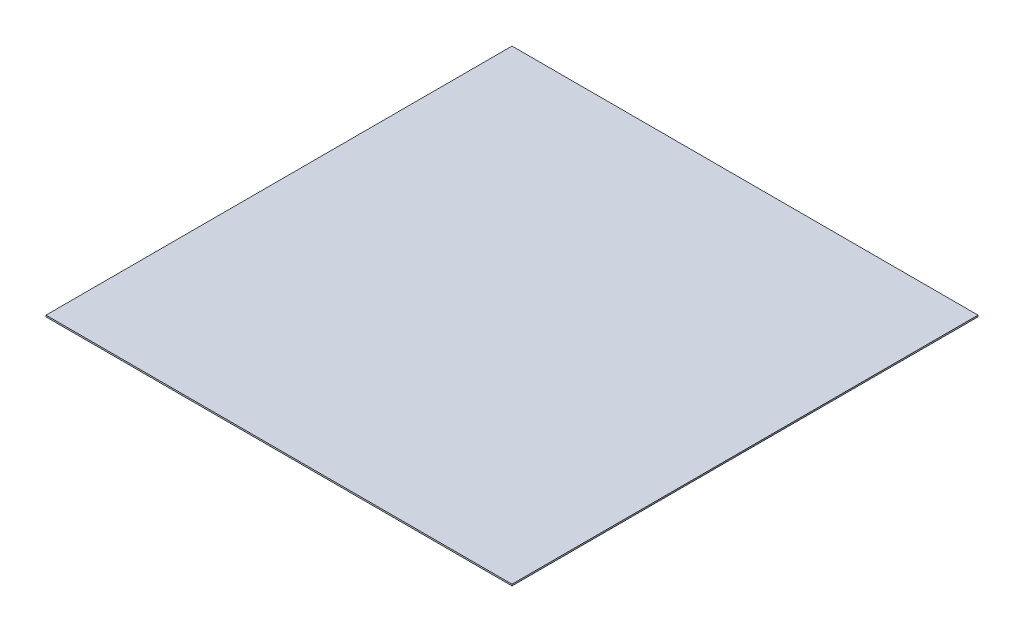
ISO-10303-21;
HEADER;
FILE_DESCRIPTION(('STEP AP214'),'2;1');
FILE_NAME('part.step','',(''),(''),'','','');
FILE_SCHEMA(('AUTOMOTIVE_DESIGN { 1 0 10303 214 1 1 1 1 }'));
ENDSEC;
DATA;
#1=APPLICATION_CONTEXT('core data for automotive mechanical design processes');
#2=APPLICATION_PROTOCOL_DEFINITION('international standard','automotive_design',2000,#1);
#3=PRODUCT_CONTEXT('',#1,'mechanical');
#4=PRODUCT('Part','Part','',(#3));
#5=PRODUCT_RELATED_PRODUCT_CATEGORY('part','',(#4));
#6=PRODUCT_DEFINITION_FORMATION('','',#4);
#7=PRODUCT_DEFINITION_CONTEXT('part definition',#1,'design');
#8=PRODUCT_DEFINITION('design','',#6,#7);
#9=PRODUCT_DEFINITION_SHAPE('','',#8);
#10=(LENGTH_UNIT() NAMED_UNIT(*) SI_UNIT(.MILLI.,.METRE.));
#11=(NAMED_UNIT(*) PLANE_ANGLE_UNIT() SI_UNIT($,.RADIAN.));
#12=(NAMED_UNIT(*) SI_UNIT($,.STERADIAN.) SOLID_ANGLE_UNIT());
#13=UNCERTAINTY_MEASURE_WITH_UNIT(LENGTH_MEASURE(1.E-05),#10,'distance_accuracy_value','');
#14=(GEOMETRIC_REPRESENTATION_CONTEXT(3) GLOBAL_UNCERTAINTY_ASSIGNED_CONTEXT((#13)) GLOBAL_UNIT_ASSIGNED_CONTEXT((#10,
#11,#12)) REPRESENTATION_CONTEXT('',''));
#15=CARTESIAN_POINT('',(0.,0.,0.));
#16=DIRECTION('',(0.,0.,1.));
#17=DIRECTION('',(1.,0.,0.));
#18=AXIS2_PLACEMENT_3D('',#15,#16,#17);
#19=CARTESIAN_POINT('',(-15000.,0.,15000.));
#20=DIRECTION('',(-1.,0.,0.));
#21=DIRECTION('',(0.,0.,1.));
#22=AXIS2_PLACEMENT_3D('',#19,#20,#21);
#23=PLANE('',#22);
#24=DIRECTION('',(0.,0.,1.));
#25=VECTOR('',#24,1.);
#26=CARTESIAN_POINT('',(-15000.,100.,15000.));
#27=LINE('',#26,#25);
#28=CARTESIAN_POINT('',(-15000.,100.,-15000.));
#29=VERTEX_POINT('',#28);
#30=CARTESIAN_POINT('',(-15000.,100.,15000.));
#31=VERTEX_POINT('',#30);
#32=EDGE_CURVE('E117',#29,#31,#27,.T.);
#33=ORIENTED_EDGE('',*,*,#32,.F.);
#34=DIRECTION('',(0.,1.,0.));
#35=VECTOR('',#34,1.);
#36=CARTESIAN_POINT('',(-15000.,0.,-15000.));
#37=LINE('',#36,#35);
#38=CARTESIAN_POINT('',(-15000.,0.,-15000.));
#39=VERTEX_POINT('',#38);
#40=EDGE_CURVE('E12',#39,#29,#37,.T.);
#41=ORIENTED_EDGE('',*,*,#40,.F.);
#42=DIRECTION('',(0.,0.,1.));
#43=VECTOR('',#42,1.);
#44=CARTESIAN_POINT('',(-15000.,0.,15000.));
#45=LINE('',#44,#43);
#46=CARTESIAN_POINT('',(-15000.,0.,15000.));
#47=VERTEX_POINT('',#46);
#48=EDGE_CURVE('E111',#39,#47,#45,.T.);
#49=ORIENTED_EDGE('',*,*,#48,.T.);
#50=DIRECTION('',(0.,1.,0.));
#51=VECTOR('',#50,1.);
#52=CARTESIAN_POINT('',(-15000.,0.,15000.));
#53=LINE('',#52,#51);
#54=EDGE_CURVE('E56',#47,#31,#53,.T.);
#55=ORIENTED_EDGE('',*,*,#54,.T.);
#56=EDGE_LOOP('',(#33,#41,#49,#55));
#57=FACE_BOUND('',#56,.T.);
#58=ADVANCED_FACE('F53',(#57),#23,.T.);
#59=CARTESIAN_POINT('',(-15000.,0.,-15000.));
#60=DIRECTION('',(0.,0.,-1.));
#61=DIRECTION('',(-1.,0.,0.));
#62=AXIS2_PLACEMENT_3D('',#59,#60,#61);
#63=PLANE('',#62);
#64=DIRECTION('',(-1.,0.,0.));
#65=VECTOR('',#64,1.);
#66=CARTESIAN_POINT('',(-15000.,100.,-15000.));
#67=LINE('',#66,#65);
#68=CARTESIAN_POINT('',(15000.,100.,-15000.));
#69=VERTEX_POINT('',#68);
#70=EDGE_CURVE('E113',#69,#29,#67,.T.);
#71=ORIENTED_EDGE('',*,*,#70,.F.);
#72=DIRECTION('',(0.,1.,0.));
#73=VECTOR('',#72,1.);
#74=CARTESIAN_POINT('',(15000.,0.,-15000.));
#75=LINE('',#74,#73);
#76=CARTESIAN_POINT('',(15000.,0.,-15000.));
#77=VERTEX_POINT('',#76);
#78=EDGE_CURVE('E62',#77,#69,#75,.T.);
#79=ORIENTED_EDGE('',*,*,#78,.F.);
#80=DIRECTION('',(-1.,0.,0.));
#81=VECTOR('',#80,1.);
#82=CARTESIAN_POINT('',(-15000.,0.,-15000.));
#83=LINE('',#82,#81);
#84=EDGE_CURVE('E108',#77,#39,#83,.T.);
#85=ORIENTED_EDGE('',*,*,#84,.T.);
#86=ORIENTED_EDGE('',*,*,#40,.T.);
#87=EDGE_LOOP('',(#71,#79,#85,#86));
#88=FACE_BOUND('',#87,.T.);
#89=ADVANCED_FACE('F127',(#88),#63,.T.);
#90=CARTESIAN_POINT('',(15000.,0.,15000.));
#91=DIRECTION('',(1.,0.,0.));
#92=DIRECTION('',(0.,0.,-1.));
#93=AXIS2_PLACEMENT_3D('',#90,#91,#92);
#94=PLANE('',#93);
#95=DIRECTION('',(0.,0.,-1.));
#96=VECTOR('',#95,1.);
#97=CARTESIAN_POINT('',(15000.,100.,15000.));
#98=LINE('',#97,#96);
#99=CARTESIAN_POINT('',(15000.,100.,15000.));
#100=VERTEX_POINT('',#99);
#101=EDGE_CURVE('E103',#100,#69,#98,.T.);
#102=ORIENTED_EDGE('',*,*,#101,.F.);
#103=DIRECTION('',(0.,1.,0.));
#104=VECTOR('',#103,1.);
#105=CARTESIAN_POINT('',(15000.,0.,15000.));
#106=LINE('',#105,#104);
#107=CARTESIAN_POINT('',(15000.,0.,15000.));
#108=VERTEX_POINT('',#107);
#109=EDGE_CURVE('E98',#108,#100,#106,.T.);
#110=ORIENTED_EDGE('',*,*,#109,.F.);
#111=DIRECTION('',(0.,0.,-1.));
#112=VECTOR('',#111,1.);
#113=CARTESIAN_POINT('',(15000.,0.,15000.));
#114=LINE('',#113,#112);
#115=EDGE_CURVE('E101',#108,#77,#114,.T.);
#116=ORIENTED_EDGE('',*,*,#115,.T.);
#117=ORIENTED_EDGE('',*,*,#78,.T.);
#118=EDGE_LOOP('',(#102,#110,#116,#117));
#119=FACE_BOUND('',#118,.T.);
#120=ADVANCED_FACE('F100',(#119),#94,.T.);
#121=CARTESIAN_POINT('',(-15000.,0.,15000.));
#122=DIRECTION('',(0.,0.,1.));
#123=DIRECTION('',(1.,0.,0.));
#124=AXIS2_PLACEMENT_3D('',#121,#122,#123);
#125=PLANE('',#124);
#126=DIRECTION('',(1.,0.,0.));
#127=VECTOR('',#126,1.);
#128=CARTESIAN_POINT('',(-15000.,100.,15000.));
#129=LINE('',#128,#127);
#130=EDGE_CURVE('E120',#31,#100,#129,.T.);
#131=ORIENTED_EDGE('',*,*,#130,.F.);
#132=ORIENTED_EDGE('',*,*,#54,.F.);
#133=DIRECTION('',(1.,0.,0.));
#134=VECTOR('',#133,1.);
#135=CARTESIAN_POINT('',(-15000.,0.,15000.));
#136=LINE('',#135,#134);
#137=EDGE_CURVE('E107',#47,#108,#136,.T.);
#138=ORIENTED_EDGE('',*,*,#137,.T.);
#139=ORIENTED_EDGE('',*,*,#109,.T.);
#140=EDGE_LOOP('',(#131,#132,#138,#139));
#141=FACE_BOUND('',#140,.T.);
#142=ADVANCED_FACE('F110',(#141),#125,.T.);
#143=CARTESIAN_POINT('',(0.,0.,0.));
#144=DIRECTION('',(0.,-1.,0.));
#145=DIRECTION('',(0.,0.,-1.));
#146=AXIS2_PLACEMENT_3D('',#143,#144,#145);
#147=PLANE('',#146);
#148=ORIENTED_EDGE('',*,*,#48,.F.);
#149=ORIENTED_EDGE('',*,*,#84,.F.);
#150=ORIENTED_EDGE('',*,*,#115,.F.);
#151=ORIENTED_EDGE('',*,*,#137,.F.);
#152=EDGE_LOOP('',(#148,#149,#150,#151));
#153=FACE_BOUND('',#152,.T.);
#154=ADVANCED_FACE('F106',(#153),#147,.T.);
#155=CARTESIAN_POINT('',(0.,100.,0.));
#156=DIRECTION('',(0.,-1.,0.));
#157=DIRECTION('',(0.,0.,-1.));
#158=AXIS2_PLACEMENT_3D('',#155,#156,#157);
#159=PLANE('',#158);
#160=ORIENTED_EDGE('',*,*,#32,.T.);
#161=ORIENTED_EDGE('',*,*,#130,.T.);
#162=ORIENTED_EDGE('',*,*,#101,.T.);
#163=ORIENTED_EDGE('',*,*,#70,.T.);
#164=EDGE_LOOP('',(#160,#161,#162,#163));
#165=FACE_BOUND('',#164,.T.);
#166=ADVANCED_FACE('F126',(#165),#159,.F.);
#167=CLOSED_SHELL('',(#58,#89,#120,#142,#154,#166));
#168=MANIFOLD_SOLID_BREP('B2',#167);
#169=CARTESIAN_POINT('',(15000.,100.,-15000.));
#170=DIRECTION('',(-1.,0.,0.));
#171=DIRECTION('',(0.,0.,1.));
#172=AXIS2_PLACEMENT_3D('',#169,#170,#171);
#173=PLANE('',#172);
#174=DIRECTION('',(0.,0.,-1.));
#175=VECTOR('',#174,1.);
#176=CARTESIAN_POINT('',(15000.,0.,-15000.));
#177=LINE('',#176,#175);
#178=CARTESIAN_POINT('',(15000.,0.,15000.));
#179=VERTEX_POINT('',#178);
#180=CARTESIAN_POINT('',(15000.,0.,-15000.));
#181=VERTEX_POINT('',#180);
#182=EDGE_CURVE('E245',#179,#181,#177,.T.);
#183=ORIENTED_EDGE('',*,*,#182,.T.);
#184=DIRECTION('',(0.,-1.,0.));
#185=VECTOR('',#184,1.);
#186=CARTESIAN_POINT('',(15000.,100.,-15000.));
#187=LINE('',#186,#185);
#188=CARTESIAN_POINT('',(15000.,100.,-15000.));
#189=VERTEX_POINT('',#188);
#190=EDGE_CURVE('E51',#189,#181,#187,.T.);
#191=ORIENTED_EDGE('',*,*,#190,.F.);
#192=DIRECTION('',(0.,0.,-1.));
#193=VECTOR('',#192,1.);
#194=CARTESIAN_POINT('',(15000.,100.,-15000.));
#195=LINE('',#194,#193);
#196=CARTESIAN_POINT('',(15000.,100.,15000.));
#197=VERTEX_POINT('',#196);
#198=EDGE_CURVE('E229',#197,#189,#195,.T.);
#199=ORIENTED_EDGE('',*,*,#198,.F.);
#200=DIRECTION('',(0.,-1.,0.));
#201=VECTOR('',#200,1.);
#202=CARTESIAN_POINT('',(15000.,100.,15000.));
#203=LINE('',#202,#201);
#204=EDGE_CURVE('E241',#197,#179,#203,.T.);
#205=ORIENTED_EDGE('',*,*,#204,.T.);
#206=EDGE_LOOP('',(#183,#191,#199,#205));
#207=FACE_BOUND('',#206,.T.);
#208=ADVANCED_FACE('F177',(#207),#173,.F.);
#209=CARTESIAN_POINT('',(-15000.,100.,-15000.));
#210=DIRECTION('',(0.,0.,1.));
#211=DIRECTION('',(1.,0.,0.));
#212=AXIS2_PLACEMENT_3D('',#209,#210,#211);
#213=PLANE('',#212);
#214=DIRECTION('',(-1.,0.,0.));
#215=VECTOR('',#214,1.);
#216=CARTESIAN_POINT('',(-15000.,0.,-15000.));
#217=LINE('',#216,#215);
#218=CARTESIAN_POINT('',(-15000.,0.,-15000.));
#219=VERTEX_POINT('',#218);
#220=EDGE_CURVE('E234',#181,#219,#217,.T.);
#221=ORIENTED_EDGE('',*,*,#220,.T.);
#222=DIRECTION('',(0.,-1.,0.));
#223=VECTOR('',#222,1.);
#224=CARTESIAN_POINT('',(-15000.,100.,-15000.));
#225=LINE('',#224,#223);
#226=CARTESIAN_POINT('',(-15000.,100.,-15000.));
#227=VERTEX_POINT('',#226);
#228=EDGE_CURVE('E186',#227,#219,#225,.T.);
#229=ORIENTED_EDGE('',*,*,#228,.F.);
#230=DIRECTION('',(-1.,0.,0.));
#231=VECTOR('',#230,1.);
#232=CARTESIAN_POINT('',(-15000.,100.,-15000.));
#233=LINE('',#232,#231);
#234=EDGE_CURVE('E224',#189,#227,#233,.T.);
#235=ORIENTED_EDGE('',*,*,#234,.F.);
#236=ORIENTED_EDGE('',*,*,#190,.T.);
#237=EDGE_LOOP('',(#221,#229,#235,#236));
#238=FACE_BOUND('',#237,.T.);
#239=ADVANCED_FACE('F233',(#238),#213,.F.);
#240=CARTESIAN_POINT('',(-15000.,100.,-15000.));
#241=DIRECTION('',(1.,0.,0.));
#242=DIRECTION('',(0.,0.,-1.));
#243=AXIS2_PLACEMENT_3D('',#240,#241,#242);
#244=PLANE('',#243);
#245=DIRECTION('',(0.,0.,1.));
#246=VECTOR('',#245,1.);
#247=CARTESIAN_POINT('',(-15000.,0.,-15000.));
#248=LINE('',#247,#246);
#249=CARTESIAN_POINT('',(-15000.,0.,15000.));
#250=VERTEX_POINT('',#249);
#251=EDGE_CURVE('E211',#219,#250,#248,.T.);
#252=ORIENTED_EDGE('',*,*,#251,.T.);
#253=DIRECTION('',(0.,-1.,0.));
#254=VECTOR('',#253,1.);
#255=CARTESIAN_POINT('',(-15000.,100.,15000.));
#256=LINE('',#255,#254);
#257=CARTESIAN_POINT('',(-15000.,100.,15000.));
#258=VERTEX_POINT('',#257);
#259=EDGE_CURVE('E236',#258,#250,#256,.T.);
#260=ORIENTED_EDGE('',*,*,#259,.F.);
#261=DIRECTION('',(0.,0.,1.));
#262=VECTOR('',#261,1.);
#263=CARTESIAN_POINT('',(-15000.,100.,-15000.));
#264=LINE('',#263,#262);
#265=EDGE_CURVE('E227',#227,#258,#264,.T.);
#266=ORIENTED_EDGE('',*,*,#265,.F.);
#267=ORIENTED_EDGE('',*,*,#228,.T.);
#268=EDGE_LOOP('',(#252,#260,#266,#267));
#269=FACE_BOUND('',#268,.T.);
#270=ADVANCED_FACE('F237',(#269),#244,.F.);
#271=CARTESIAN_POINT('',(-15000.,100.,15000.));
#272=DIRECTION('',(0.,0.,-1.));
#273=DIRECTION('',(-1.,0.,0.));
#274=AXIS2_PLACEMENT_3D('',#271,#272,#273);
#275=PLANE('',#274);
#276=DIRECTION('',(1.,0.,0.));
#277=VECTOR('',#276,1.);
#278=CARTESIAN_POINT('',(-15000.,0.,15000.));
#279=LINE('',#278,#277);
#280=EDGE_CURVE('E217',#250,#179,#279,.T.);
#281=ORIENTED_EDGE('',*,*,#280,.T.);
#282=ORIENTED_EDGE('',*,*,#204,.F.);
#283=DIRECTION('',(1.,0.,0.));
#284=VECTOR('',#283,1.);
#285=CARTESIAN_POINT('',(-15000.,100.,15000.));
#286=LINE('',#285,#284);
#287=EDGE_CURVE('E194',#258,#197,#286,.T.);
#288=ORIENTED_EDGE('',*,*,#287,.F.);
#289=ORIENTED_EDGE('',*,*,#259,.T.);
#290=EDGE_LOOP('',(#281,#282,#288,#289));
#291=FACE_BOUND('',#290,.T.);
#292=ADVANCED_FACE('F258',(#291),#275,.F.);
#293=CARTESIAN_POINT('',(0.,100.,0.));
#294=DIRECTION('',(0.,1.,0.));
#295=DIRECTION('',(0.,0.,1.));
#296=AXIS2_PLACEMENT_3D('',#293,#294,#295);
#297=PLANE('',#296);
#298=ORIENTED_EDGE('',*,*,#198,.T.);
#299=ORIENTED_EDGE('',*,*,#234,.T.);
#300=ORIENTED_EDGE('',*,*,#265,.T.);
#301=ORIENTED_EDGE('',*,*,#287,.T.);
#302=EDGE_LOOP('',(#298,#299,#300,#301));
#303=FACE_BOUND('',#302,.T.);
#304=ADVANCED_FACE('F225',(#303),#297,.T.);
#305=CARTESIAN_POINT('',(0.,0.,0.));
#306=DIRECTION('',(0.,1.,0.));
#307=DIRECTION('',(0.,0.,1.));
#308=AXIS2_PLACEMENT_3D('',#305,#306,#307);
#309=PLANE('',#308);
#310=ORIENTED_EDGE('',*,*,#182,.F.);
#311=ORIENTED_EDGE('',*,*,#280,.F.);
#312=ORIENTED_EDGE('',*,*,#251,.F.);
#313=ORIENTED_EDGE('',*,*,#220,.F.);
#314=EDGE_LOOP('',(#310,#311,#312,#313));
#315=FACE_BOUND('',#314,.T.);
#316=ADVANCED_FACE('F261',(#315),#309,.F.);
#317=CLOSED_SHELL('',(#208,#239,#270,#292,#304,#316));
#318=MANIFOLD_SOLID_BREP('B6',#317);
#319=ADVANCED_BREP_SHAPE_REPRESENTATION('',(#18,#168,#318),#14);
#320=SHAPE_DEFINITION_REPRESENTATION(#9,#319);
ENDSEC;
END-ISO-10303-21;
